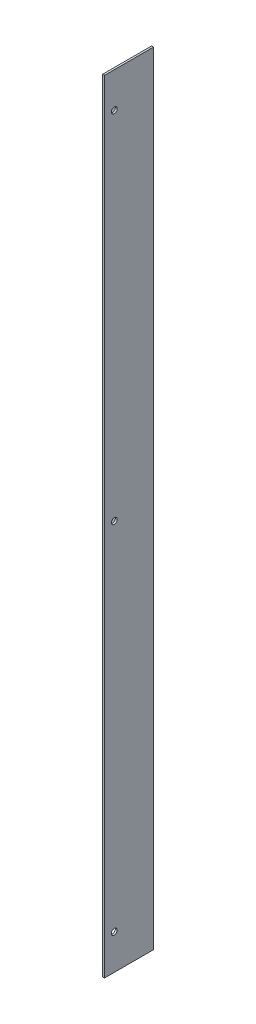
ISO-10303-21;
HEADER;
FILE_DESCRIPTION(('STEP AP214'),'2;1');
FILE_NAME('part.step','',(''),(''),'','','');
FILE_SCHEMA(('AUTOMOTIVE_DESIGN { 1 0 10303 214 1 1 1 1 }'));
ENDSEC;
DATA;
#1=APPLICATION_CONTEXT('core data for automotive mechanical design processes');
#2=APPLICATION_PROTOCOL_DEFINITION('international standard','automotive_design',2000,#1);
#3=PRODUCT_CONTEXT('',#1,'mechanical');
#4=PRODUCT('Part','Part','',(#3));
#5=PRODUCT_RELATED_PRODUCT_CATEGORY('part','',(#4));
#6=PRODUCT_DEFINITION_FORMATION('','',#4);
#7=PRODUCT_DEFINITION_CONTEXT('part definition',#1,'design');
#8=PRODUCT_DEFINITION('design','',#6,#7);
#9=PRODUCT_DEFINITION_SHAPE('','',#8);
#10=(LENGTH_UNIT() NAMED_UNIT(*) SI_UNIT(.MILLI.,.METRE.));
#11=(NAMED_UNIT(*) PLANE_ANGLE_UNIT() SI_UNIT($,.RADIAN.));
#12=(NAMED_UNIT(*) SI_UNIT($,.STERADIAN.) SOLID_ANGLE_UNIT());
#13=UNCERTAINTY_MEASURE_WITH_UNIT(LENGTH_MEASURE(1.E-05),#10,'distance_accuracy_value','');
#14=(GEOMETRIC_REPRESENTATION_CONTEXT(3) GLOBAL_UNCERTAINTY_ASSIGNED_CONTEXT((#13)) GLOBAL_UNIT_ASSIGNED_CONTEXT((#10,
#11,#12)) REPRESENTATION_CONTEXT('',''));
#15=CARTESIAN_POINT('',(0.,0.,0.));
#16=DIRECTION('',(0.,0.,1.));
#17=DIRECTION('',(1.,0.,0.));
#18=AXIS2_PLACEMENT_3D('',#15,#16,#17);
#19=CARTESIAN_POINT('',(-55.4417853066137,107.180375226279,25.));
#20=DIRECTION('',(1.,0.,0.));
#21=DIRECTION('',(0.,1.,0.));
#22=AXIS2_PLACEMENT_3D('',#19,#20,#21);
#23=PLANE('',#22);
#24=CARTESIAN_POINT('',(-55.4417853066137,89.1803752262787,20.));
#25=DIRECTION('',(1.,0.,0.));
#26=DIRECTION('',(0.,1.,0.));
#27=AXIS2_PLACEMENT_3D('',#24,#25,#26);
#28=CIRCLE('',#27,1.5);
#29=CARTESIAN_POINT('',(-55.4417853066137,90.6803752262787,20.));
#30=VERTEX_POINT('',#29);
#31=EDGE_CURVE('E155',#30,#30,#28,.T.);
#32=ORIENTED_EDGE('',*,*,#31,.T.);
#33=EDGE_LOOP('',(#32));
#34=FACE_BOUND('',#33,.T.);
#35=CARTESIAN_POINT('',(-55.4417853066137,-274.819624773721,20.));
#36=DIRECTION('',(1.,0.,0.));
#37=DIRECTION('',(0.,1.,0.));
#38=AXIS2_PLACEMENT_3D('',#35,#36,#37);
#39=CIRCLE('',#38,1.5);
#40=CARTESIAN_POINT('',(-55.4417853066137,-273.319624773721,20.));
#41=VERTEX_POINT('',#40);
#42=EDGE_CURVE('E149',#41,#41,#39,.T.);
#43=ORIENTED_EDGE('',*,*,#42,.T.);
#44=EDGE_LOOP('',(#43));
#45=FACE_BOUND('',#44,.T.);
#46=CARTESIAN_POINT('',(-55.4417853066137,-92.8196247737213,20.));
#47=DIRECTION('',(1.,0.,0.));
#48=DIRECTION('',(0.,1.,0.));
#49=AXIS2_PLACEMENT_3D('',#46,#47,#48);
#50=CIRCLE('',#49,1.5);
#51=CARTESIAN_POINT('',(-55.4417853066137,-91.3196247737213,20.));
#52=VERTEX_POINT('',#51);
#53=EDGE_CURVE('E140',#52,#52,#50,.T.);
#54=ORIENTED_EDGE('',*,*,#53,.T.);
#55=EDGE_LOOP('',(#54));
#56=FACE_BOUND('',#55,.T.);
#57=DIRECTION('',(0.,1.,0.));
#58=VECTOR('',#57,1.);
#59=CARTESIAN_POINT('',(-55.4417853066137,107.180375226279,1.));
#60=LINE('',#59,#58);
#61=CARTESIAN_POINT('',(-55.4417853066137,-292.819624773721,1.));
#62=VERTEX_POINT('',#61);
#63=CARTESIAN_POINT('',(-55.4417853066137,107.180375226279,1.));
#64=VERTEX_POINT('',#63);
#65=EDGE_CURVE('E48',#62,#64,#60,.T.);
#66=ORIENTED_EDGE('',*,*,#65,.F.);
#67=DIRECTION('',(0.,0.,-1.));
#68=VECTOR('',#67,1.);
#69=CARTESIAN_POINT('',(-55.4417853066137,-292.819624773721,25.));
#70=LINE('',#69,#68);
#71=CARTESIAN_POINT('',(-55.4417853066137,-292.819624773721,25.));
#72=VERTEX_POINT('',#71);
#73=EDGE_CURVE('E11',#72,#62,#70,.T.);
#74=ORIENTED_EDGE('',*,*,#73,.F.);
#75=DIRECTION('',(0.,-1.,0.));
#76=VECTOR('',#75,1.);
#77=CARTESIAN_POINT('',(-55.4417853066137,107.180375226279,25.));
#78=LINE('',#77,#76);
#79=CARTESIAN_POINT('',(-55.4417853066137,107.180375226279,25.));
#80=VERTEX_POINT('',#79);
#81=EDGE_CURVE('E101',#80,#72,#78,.T.);
#82=ORIENTED_EDGE('',*,*,#81,.F.);
#83=DIRECTION('',(0.,0.,-1.));
#84=VECTOR('',#83,1.);
#85=CARTESIAN_POINT('',(-55.4417853066137,107.180375226279,25.));
#86=LINE('',#85,#84);
#87=EDGE_CURVE('E100',#80,#64,#86,.T.);
#88=ORIENTED_EDGE('',*,*,#87,.T.);
#89=EDGE_LOOP('',(#66,#74,#82,#88));
#90=FACE_BOUND('',#89,.T.);
#91=ADVANCED_FACE('F32',(#34,#45,#56,#90),#23,.F.);
#92=CARTESIAN_POINT('',(-55.4417853066137,-292.819624773721,25.));
#93=DIRECTION('',(0.,1.,0.));
#94=DIRECTION('',(0.,0.,1.));
#95=AXIS2_PLACEMENT_3D('',#92,#93,#94);
#96=PLANE('',#95);
#97=DIRECTION('',(1.,0.,0.));
#98=VECTOR('',#97,1.);
#99=CARTESIAN_POINT('',(-55.4417853066137,-292.819624773721,0.));
#100=LINE('',#99,#98);
#101=CARTESIAN_POINT('',(-55.4417853066137,-292.819624773721,0.));
#102=VERTEX_POINT('',#101);
#103=CARTESIAN_POINT('',(-54.4417853066137,-292.819624773721,0.));
#104=VERTEX_POINT('',#103);
#105=EDGE_CURVE('E158',#102,#104,#100,.T.);
#106=ORIENTED_EDGE('',*,*,#105,.T.);
#107=DIRECTION('',(0.,0.,-1.));
#108=VECTOR('',#107,1.);
#109=CARTESIAN_POINT('',(-54.4417853066137,-292.819624773721,25.));
#110=LINE('',#109,#108);
#111=CARTESIAN_POINT('',(-54.4417853066137,-292.819624773721,25.));
#112=VERTEX_POINT('',#111);
#113=EDGE_CURVE('E40',#112,#104,#110,.T.);
#114=ORIENTED_EDGE('',*,*,#113,.F.);
#115=DIRECTION('',(1.,0.,0.));
#116=VECTOR('',#115,1.);
#117=CARTESIAN_POINT('',(-55.4417853066137,-292.819624773721,25.));
#118=LINE('',#117,#116);
#119=EDGE_CURVE('E85',#72,#112,#118,.T.);
#120=ORIENTED_EDGE('',*,*,#119,.F.);
#121=ORIENTED_EDGE('',*,*,#73,.T.);
#122=DIRECTION('',(0.,0.,-1.));
#123=VECTOR('',#122,1.);
#124=CARTESIAN_POINT('',(-55.4417853066137,-292.819624773721,1.));
#125=LINE('',#124,#123);
#126=EDGE_CURVE('E109',#62,#102,#125,.T.);
#127=ORIENTED_EDGE('',*,*,#126,.T.);
#128=EDGE_LOOP('',(#106,#114,#120,#121,#127));
#129=FACE_BOUND('',#128,.T.);
#130=ADVANCED_FACE('F211',(#129),#96,.F.);
#131=CARTESIAN_POINT('',(-54.4417853066137,107.180375226279,25.));
#132=DIRECTION('',(-1.,0.,0.));
#133=DIRECTION('',(0.,-1.,0.));
#134=AXIS2_PLACEMENT_3D('',#131,#132,#133);
#135=PLANE('',#134);
#136=CARTESIAN_POINT('',(-54.4417853066137,-92.8196247737213,20.));
#137=DIRECTION('',(1.,0.,0.));
#138=DIRECTION('',(0.,1.,0.));
#139=AXIS2_PLACEMENT_3D('',#136,#137,#138);
#140=CIRCLE('',#139,1.5);
#141=CARTESIAN_POINT('',(-54.4417853066137,-91.3196247737213,20.));
#142=VERTEX_POINT('',#141);
#143=EDGE_CURVE('E137',#142,#142,#140,.T.);
#144=ORIENTED_EDGE('',*,*,#143,.F.);
#145=EDGE_LOOP('',(#144));
#146=FACE_BOUND('',#145,.T.);
#147=CARTESIAN_POINT('',(-54.4417853066137,-274.819624773721,20.));
#148=DIRECTION('',(1.,0.,0.));
#149=DIRECTION('',(0.,1.,0.));
#150=AXIS2_PLACEMENT_3D('',#147,#148,#149);
#151=CIRCLE('',#150,1.5);
#152=CARTESIAN_POINT('',(-54.4417853066137,-273.319624773721,20.));
#153=VERTEX_POINT('',#152);
#154=EDGE_CURVE('E145',#153,#153,#151,.T.);
#155=ORIENTED_EDGE('',*,*,#154,.F.);
#156=EDGE_LOOP('',(#155));
#157=FACE_BOUND('',#156,.T.);
#158=CARTESIAN_POINT('',(-54.4417853066137,89.1803752262787,20.));
#159=DIRECTION('',(1.,0.,0.));
#160=DIRECTION('',(0.,1.,0.));
#161=AXIS2_PLACEMENT_3D('',#158,#159,#160);
#162=CIRCLE('',#161,1.5);
#163=CARTESIAN_POINT('',(-54.4417853066137,90.6803752262787,20.));
#164=VERTEX_POINT('',#163);
#165=EDGE_CURVE('E152',#164,#164,#162,.T.);
#166=ORIENTED_EDGE('',*,*,#165,.F.);
#167=EDGE_LOOP('',(#166));
#168=FACE_BOUND('',#167,.T.);
#169=DIRECTION('',(0.,1.,0.));
#170=VECTOR('',#169,1.);
#171=CARTESIAN_POINT('',(-54.4417853066137,107.180375226279,0.));
#172=LINE('',#171,#170);
#173=CARTESIAN_POINT('',(-54.4417853066137,107.180375226279,0.));
#174=VERTEX_POINT('',#173);
#175=EDGE_CURVE('E167',#104,#174,#172,.T.);
#176=ORIENTED_EDGE('',*,*,#175,.T.);
#177=DIRECTION('',(0.,0.,-1.));
#178=VECTOR('',#177,1.);
#179=CARTESIAN_POINT('',(-54.4417853066137,107.180375226279,25.));
#180=LINE('',#179,#178);
#181=CARTESIAN_POINT('',(-54.4417853066137,107.180375226279,25.));
#182=VERTEX_POINT('',#181);
#183=EDGE_CURVE('E102',#182,#174,#180,.T.);
#184=ORIENTED_EDGE('',*,*,#183,.F.);
#185=DIRECTION('',(0.,1.,0.));
#186=VECTOR('',#185,1.);
#187=CARTESIAN_POINT('',(-54.4417853066137,107.180375226279,25.));
#188=LINE('',#187,#186);
#189=EDGE_CURVE('E163',#112,#182,#188,.T.);
#190=ORIENTED_EDGE('',*,*,#189,.F.);
#191=ORIENTED_EDGE('',*,*,#113,.T.);
#192=EDGE_LOOP('',(#176,#184,#190,#191));
#193=FACE_BOUND('',#192,.T.);
#194=ADVANCED_FACE('F216',(#146,#157,#168,#193),#135,.F.);
#195=CARTESIAN_POINT('',(-55.4417853066137,107.180375226279,25.));
#196=DIRECTION('',(0.,-1.,0.));
#197=DIRECTION('',(0.,0.,-1.));
#198=AXIS2_PLACEMENT_3D('',#195,#196,#197);
#199=PLANE('',#198);
#200=DIRECTION('',(-1.,0.,0.));
#201=VECTOR('',#200,1.);
#202=CARTESIAN_POINT('',(-55.4417853066137,107.180375226279,0.));
#203=LINE('',#202,#201);
#204=CARTESIAN_POINT('',(-55.4417853066137,107.180375226279,0.));
#205=VERTEX_POINT('',#204);
#206=EDGE_CURVE('E78',#174,#205,#203,.T.);
#207=ORIENTED_EDGE('',*,*,#206,.T.);
#208=DIRECTION('',(0.,0.,-1.));
#209=VECTOR('',#208,1.);
#210=CARTESIAN_POINT('',(-55.4417853066137,107.180375226279,1.));
#211=LINE('',#210,#209);
#212=EDGE_CURVE('E104',#64,#205,#211,.T.);
#213=ORIENTED_EDGE('',*,*,#212,.F.);
#214=ORIENTED_EDGE('',*,*,#87,.F.);
#215=DIRECTION('',(-1.,0.,0.));
#216=VECTOR('',#215,1.);
#217=CARTESIAN_POINT('',(-55.4417853066137,107.180375226279,25.));
#218=LINE('',#217,#216);
#219=EDGE_CURVE('E56',#182,#80,#218,.T.);
#220=ORIENTED_EDGE('',*,*,#219,.F.);
#221=ORIENTED_EDGE('',*,*,#183,.T.);
#222=EDGE_LOOP('',(#207,#213,#214,#220,#221));
#223=FACE_BOUND('',#222,.T.);
#224=ADVANCED_FACE('F105',(#223),#199,.F.);
#225=CARTESIAN_POINT('',(0.,0.,25.));
#226=DIRECTION('',(0.,0.,1.));
#227=DIRECTION('',(1.,0.,0.));
#228=AXIS2_PLACEMENT_3D('',#225,#226,#227);
#229=PLANE('',#228);
#230=ORIENTED_EDGE('',*,*,#81,.T.);
#231=ORIENTED_EDGE('',*,*,#119,.T.);
#232=ORIENTED_EDGE('',*,*,#189,.T.);
#233=ORIENTED_EDGE('',*,*,#219,.T.);
#234=EDGE_LOOP('',(#230,#231,#232,#233));
#235=FACE_BOUND('',#234,.T.);
#236=ADVANCED_FACE('F235',(#235),#229,.T.);
#237=CARTESIAN_POINT('',(0.,0.,0.));
#238=DIRECTION('',(0.,0.,1.));
#239=DIRECTION('',(1.,0.,0.));
#240=AXIS2_PLACEMENT_3D('',#237,#238,#239);
#241=PLANE('',#240);
#242=ORIENTED_EDGE('',*,*,#105,.F.);
#243=DIRECTION('',(0.707106781186545,-0.707106781186551,0.));
#244=VECTOR('',#243,1.);
#245=CARTESIAN_POINT('',(-55.4417853066137,-292.819624773721,0.));
#246=LINE('',#245,#244);
#247=CARTESIAN_POINT('',(-79.4417853066137,-268.819624773721,0.));
#248=VERTEX_POINT('',#247);
#249=EDGE_CURVE('E180',#248,#102,#246,.T.);
#250=ORIENTED_EDGE('',*,*,#249,.F.);
#251=DIRECTION('',(0.,-1.,0.));
#252=VECTOR('',#251,1.);
#253=CARTESIAN_POINT('',(-79.4417853066137,83.1803752262788,0.));
#254=LINE('',#253,#252);
#255=CARTESIAN_POINT('',(-79.4417853066137,83.1803752262788,0.));
#256=VERTEX_POINT('',#255);
#257=EDGE_CURVE('E135',#256,#248,#254,.T.);
#258=ORIENTED_EDGE('',*,*,#257,.F.);
#259=DIRECTION('',(-0.707106781186548,-0.707106781186547,0.));
#260=VECTOR('',#259,1.);
#261=CARTESIAN_POINT('',(-55.4417853066137,107.180375226279,0.));
#262=LINE('',#261,#260);
#263=EDGE_CURVE('E183',#205,#256,#262,.T.);
#264=ORIENTED_EDGE('',*,*,#263,.F.);
#265=ORIENTED_EDGE('',*,*,#206,.F.);
#266=ORIENTED_EDGE('',*,*,#175,.F.);
#267=EDGE_LOOP('',(#242,#250,#258,#264,#265,#266));
#268=FACE_BOUND('',#267,.T.);
#269=CARTESIAN_POINT('',(-74.4417853066137,47.1803752262787,0.));
#270=DIRECTION('',(0.,0.,1.));
#271=DIRECTION('',(1.,0.,0.));
#272=AXIS2_PLACEMENT_3D('',#269,#270,#271);
#273=CIRCLE('',#272,1.5);
#274=CARTESIAN_POINT('',(-72.9417853066137,47.1803752262787,0.));
#275=VERTEX_POINT('',#274);
#276=EDGE_CURVE('E177',#275,#275,#273,.T.);
#277=ORIENTED_EDGE('',*,*,#276,.T.);
#278=EDGE_LOOP('',(#277));
#279=FACE_BOUND('',#278,.T.);
#280=CARTESIAN_POINT('',(-74.4417853066137,-232.819624773721,0.));
#281=DIRECTION('',(0.,0.,1.));
#282=DIRECTION('',(1.,0.,0.));
#283=AXIS2_PLACEMENT_3D('',#280,#281,#282);
#284=CIRCLE('',#283,1.5);
#285=CARTESIAN_POINT('',(-72.9417853066137,-232.819624773721,0.));
#286=VERTEX_POINT('',#285);
#287=EDGE_CURVE('E357',#286,#286,#284,.T.);
#288=ORIENTED_EDGE('',*,*,#287,.T.);
#289=EDGE_LOOP('',(#288));
#290=FACE_BOUND('',#289,.T.);
#291=ADVANCED_FACE('F194',(#268,#279,#290),#241,.F.);
#292=CARTESIAN_POINT('',(-55.4417853066137,89.1803752262787,20.));
#293=DIRECTION('',(1.,0.,0.));
#294=DIRECTION('',(0.,1.,0.));
#295=AXIS2_PLACEMENT_3D('',#292,#293,#294);
#296=CYLINDRICAL_SURFACE('',#295,1.5);
#297=ORIENTED_EDGE('',*,*,#31,.F.);
#298=EDGE_LOOP('',(#297));
#299=FACE_BOUND('',#298,.T.);
#300=ORIENTED_EDGE('',*,*,#165,.T.);
#301=EDGE_LOOP('',(#300));
#302=FACE_BOUND('',#301,.T.);
#303=ADVANCED_FACE('F228',(#299,#302),#296,.F.);
#304=CARTESIAN_POINT('',(-55.4417853066137,-274.819624773721,20.));
#305=DIRECTION('',(1.,0.,0.));
#306=DIRECTION('',(0.,1.,0.));
#307=AXIS2_PLACEMENT_3D('',#304,#305,#306);
#308=CYLINDRICAL_SURFACE('',#307,1.5);
#309=ORIENTED_EDGE('',*,*,#42,.F.);
#310=EDGE_LOOP('',(#309));
#311=FACE_BOUND('',#310,.T.);
#312=ORIENTED_EDGE('',*,*,#154,.T.);
#313=EDGE_LOOP('',(#312));
#314=FACE_BOUND('',#313,.T.);
#315=ADVANCED_FACE('F224',(#311,#314),#308,.F.);
#316=CARTESIAN_POINT('',(-55.4417853066137,-92.8196247737213,20.));
#317=DIRECTION('',(1.,0.,0.));
#318=DIRECTION('',(0.,1.,0.));
#319=AXIS2_PLACEMENT_3D('',#316,#317,#318);
#320=CYLINDRICAL_SURFACE('',#319,1.5);
#321=ORIENTED_EDGE('',*,*,#53,.F.);
#322=EDGE_LOOP('',(#321));
#323=FACE_BOUND('',#322,.T.);
#324=ORIENTED_EDGE('',*,*,#143,.T.);
#325=EDGE_LOOP('',(#324));
#326=FACE_BOUND('',#325,.T.);
#327=ADVANCED_FACE('F206',(#323,#326),#320,.F.);
#328=CARTESIAN_POINT('',(0.,0.,1.));
#329=DIRECTION('',(0.,0.,1.));
#330=DIRECTION('',(1.,0.,0.));
#331=AXIS2_PLACEMENT_3D('',#328,#329,#330);
#332=PLANE('',#331);
#333=CARTESIAN_POINT('',(-74.4417853066137,47.1803752262787,1.));
#334=DIRECTION('',(0.,0.,1.));
#335=DIRECTION('',(1.,0.,0.));
#336=AXIS2_PLACEMENT_3D('',#333,#334,#335);
#337=CIRCLE('',#336,1.5);
#338=CARTESIAN_POINT('',(-72.9417853066137,47.1803752262787,1.));
#339=VERTEX_POINT('',#338);
#340=EDGE_CURVE('E184',#339,#339,#337,.T.);
#341=ORIENTED_EDGE('',*,*,#340,.F.);
#342=EDGE_LOOP('',(#341));
#343=FACE_BOUND('',#342,.T.);
#344=DIRECTION('',(0.707106781186545,-0.707106781186551,0.));
#345=VECTOR('',#344,1.);
#346=CARTESIAN_POINT('',(-55.4417853066137,-292.819624773721,1.));
#347=LINE('',#346,#345);
#348=CARTESIAN_POINT('',(-79.4417853066137,-268.819624773721,1.));
#349=VERTEX_POINT('',#348);
#350=EDGE_CURVE('E119',#349,#62,#347,.T.);
#351=ORIENTED_EDGE('',*,*,#350,.T.);
#352=ORIENTED_EDGE('',*,*,#65,.T.);
#353=DIRECTION('',(-0.707106781186548,-0.707106781186547,0.));
#354=VECTOR('',#353,1.);
#355=CARTESIAN_POINT('',(-55.4417853066137,107.180375226279,1.));
#356=LINE('',#355,#354);
#357=CARTESIAN_POINT('',(-79.4417853066137,83.1803752262788,1.));
#358=VERTEX_POINT('',#357);
#359=EDGE_CURVE('E116',#64,#358,#356,.T.);
#360=ORIENTED_EDGE('',*,*,#359,.T.);
#361=DIRECTION('',(0.,-1.,0.));
#362=VECTOR('',#361,1.);
#363=CARTESIAN_POINT('',(-79.4417853066137,83.1803752262788,1.));
#364=LINE('',#363,#362);
#365=EDGE_CURVE('E125',#358,#349,#364,.T.);
#366=ORIENTED_EDGE('',*,*,#365,.T.);
#367=EDGE_LOOP('',(#351,#352,#360,#366));
#368=FACE_BOUND('',#367,.T.);
#369=CARTESIAN_POINT('',(-74.4417853066137,-232.819624773721,1.));
#370=DIRECTION('',(0.,0.,1.));
#371=DIRECTION('',(1.,0.,0.));
#372=AXIS2_PLACEMENT_3D('',#369,#370,#371);
#373=CIRCLE('',#372,1.5);
#374=CARTESIAN_POINT('',(-72.9417853066137,-232.819624773721,1.));
#375=VERTEX_POINT('',#374);
#376=EDGE_CURVE('E354',#375,#375,#373,.T.);
#377=ORIENTED_EDGE('',*,*,#376,.F.);
#378=EDGE_LOOP('',(#377));
#379=FACE_BOUND('',#378,.T.);
#380=ADVANCED_FACE('F114',(#343,#368,#379),#332,.T.);
#381=CARTESIAN_POINT('',(-55.4417853066137,-292.819624773721,1.));
#382=DIRECTION('',(0.707106781186551,0.707106781186545,0.));
#383=DIRECTION('',(-0.707106781186545,0.707106781186551,0.));
#384=AXIS2_PLACEMENT_3D('',#381,#382,#383);
#385=PLANE('',#384);
#386=ORIENTED_EDGE('',*,*,#249,.T.);
#387=ORIENTED_EDGE('',*,*,#126,.F.);
#388=ORIENTED_EDGE('',*,*,#350,.F.);
#389=DIRECTION('',(0.,0.,-1.));
#390=VECTOR('',#389,1.);
#391=CARTESIAN_POINT('',(-79.4417853066137,-268.819624773721,1.));
#392=LINE('',#391,#390);
#393=EDGE_CURVE('E127',#349,#248,#392,.T.);
#394=ORIENTED_EDGE('',*,*,#393,.T.);
#395=EDGE_LOOP('',(#386,#387,#388,#394));
#396=FACE_BOUND('',#395,.T.);
#397=ADVANCED_FACE('F198',(#396),#385,.F.);
#398=CARTESIAN_POINT('',(-55.4417853066137,107.180375226279,1.));
#399=DIRECTION('',(0.707106781186547,-0.707106781186548,0.));
#400=DIRECTION('',(0.707106781186548,0.707106781186547,0.));
#401=AXIS2_PLACEMENT_3D('',#398,#399,#400);
#402=PLANE('',#401);
#403=ORIENTED_EDGE('',*,*,#263,.T.);
#404=DIRECTION('',(0.,0.,-1.));
#405=VECTOR('',#404,1.);
#406=CARTESIAN_POINT('',(-79.4417853066137,83.1803752262788,1.));
#407=LINE('',#406,#405);
#408=EDGE_CURVE('E110',#358,#256,#407,.T.);
#409=ORIENTED_EDGE('',*,*,#408,.F.);
#410=ORIENTED_EDGE('',*,*,#359,.F.);
#411=ORIENTED_EDGE('',*,*,#212,.T.);
#412=EDGE_LOOP('',(#403,#409,#410,#411));
#413=FACE_BOUND('',#412,.T.);
#414=ADVANCED_FACE('F122',(#413),#402,.F.);
#415=CARTESIAN_POINT('',(-79.4417853066137,83.1803752262788,1.));
#416=DIRECTION('',(1.,0.,0.));
#417=DIRECTION('',(0.,0.,-1.));
#418=AXIS2_PLACEMENT_3D('',#415,#416,#417);
#419=PLANE('',#418);
#420=ORIENTED_EDGE('',*,*,#257,.T.);
#421=ORIENTED_EDGE('',*,*,#393,.F.);
#422=ORIENTED_EDGE('',*,*,#365,.F.);
#423=ORIENTED_EDGE('',*,*,#408,.T.);
#424=EDGE_LOOP('',(#420,#421,#422,#423));
#425=FACE_BOUND('',#424,.T.);
#426=ADVANCED_FACE('F190',(#425),#419,.F.);
#427=CARTESIAN_POINT('',(-74.4417853066137,47.1803752262787,1.));
#428=DIRECTION('',(0.,0.,-1.));
#429=DIRECTION('',(-1.,0.,0.));
#430=AXIS2_PLACEMENT_3D('',#427,#428,#429);
#431=CYLINDRICAL_SURFACE('',#430,1.5);
#432=ORIENTED_EDGE('',*,*,#340,.T.);
#433=EDGE_LOOP('',(#432));
#434=FACE_BOUND('',#433,.T.);
#435=ORIENTED_EDGE('',*,*,#276,.F.);
#436=EDGE_LOOP('',(#435));
#437=FACE_BOUND('',#436,.T.);
#438=ADVANCED_FACE('F328',(#434,#437),#431,.F.);
#439=CARTESIAN_POINT('',(-74.4417853066137,-232.819624773721,1.));
#440=DIRECTION('',(0.,0.,-1.));
#441=DIRECTION('',(-1.,0.,0.));
#442=AXIS2_PLACEMENT_3D('',#439,#440,#441);
#443=CYLINDRICAL_SURFACE('',#442,1.5);
#444=ORIENTED_EDGE('',*,*,#376,.T.);
#445=EDGE_LOOP('',(#444));
#446=FACE_BOUND('',#445,.T.);
#447=ORIENTED_EDGE('',*,*,#287,.F.);
#448=EDGE_LOOP('',(#447));
#449=FACE_BOUND('',#448,.T.);
#450=ADVANCED_FACE('F336',(#446,#449),#443,.F.);
#451=CLOSED_SHELL('',(#91,#130,#194,#224,#236,#291,#303,#315,#327,#380,#397,#414,#426,#438,#450));
#452=MANIFOLD_SOLID_BREP('B2',#451);
#453=ADVANCED_BREP_SHAPE_REPRESENTATION('',(#18,#452),#14);
#454=SHAPE_DEFINITION_REPRESENTATION(#9,#453);
ENDSEC;
END-ISO-10303-21;
